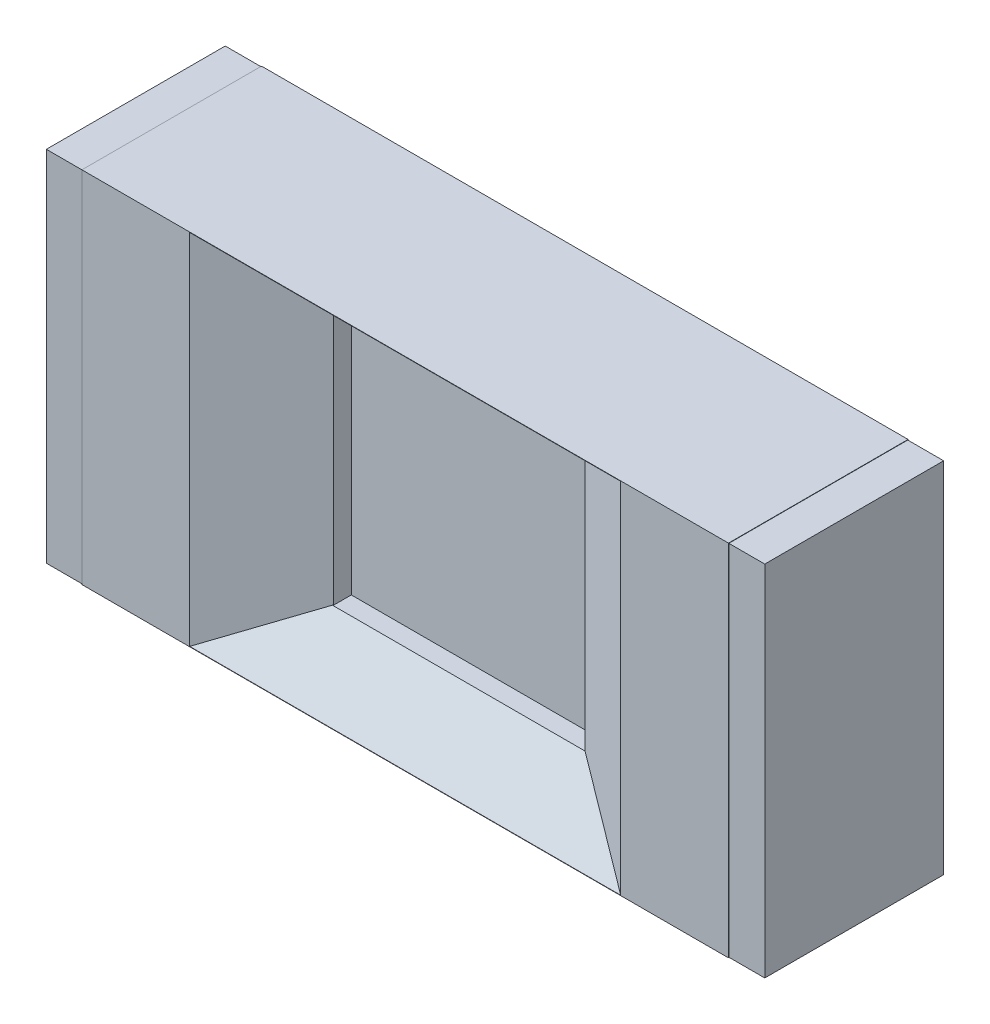
ISO-10303-21;
HEADER;
FILE_DESCRIPTION(('STEP AP214'),'2;1');
FILE_NAME('part.step','',(''),(''),'','','');
FILE_SCHEMA(('AUTOMOTIVE_DESIGN { 1 0 10303 214 1 1 1 1 }'));
ENDSEC;
DATA;
#1=APPLICATION_CONTEXT('core data for automotive mechanical design processes');
#2=APPLICATION_PROTOCOL_DEFINITION('international standard','automotive_design',2000,#1);
#3=PRODUCT_CONTEXT('',#1,'mechanical');
#4=PRODUCT('Part','Part','',(#3));
#5=PRODUCT_RELATED_PRODUCT_CATEGORY('part','',(#4));
#6=PRODUCT_DEFINITION_FORMATION('','',#4);
#7=PRODUCT_DEFINITION_CONTEXT('part definition',#1,'design');
#8=PRODUCT_DEFINITION('design','',#6,#7);
#9=PRODUCT_DEFINITION_SHAPE('','',#8);
#10=(LENGTH_UNIT() NAMED_UNIT(*) SI_UNIT(.MILLI.,.METRE.));
#11=(NAMED_UNIT(*) PLANE_ANGLE_UNIT() SI_UNIT($,.RADIAN.));
#12=(NAMED_UNIT(*) SI_UNIT($,.STERADIAN.) SOLID_ANGLE_UNIT());
#13=UNCERTAINTY_MEASURE_WITH_UNIT(LENGTH_MEASURE(1.E-05),#10,'distance_accuracy_value','');
#14=(GEOMETRIC_REPRESENTATION_CONTEXT(3) GLOBAL_UNCERTAINTY_ASSIGNED_CONTEXT((#13)) GLOBAL_UNIT_ASSIGNED_CONTEXT((#10,
#11,#12)) REPRESENTATION_CONTEXT('',''));
#15=CARTESIAN_POINT('',(0.,0.,0.));
#16=DIRECTION('',(0.,0.,1.));
#17=DIRECTION('',(1.,0.,0.));
#18=AXIS2_PLACEMENT_3D('',#15,#16,#17);
#19=CARTESIAN_POINT('',(28.13,-12.,3.201));
#20=DIRECTION('',(0.,0.,-1.));
#21=DIRECTION('',(0.,-1.,0.));
#22=AXIS2_PLACEMENT_3D('',#19,#20,#21);
#23=PLANE('',#22);
#24=DIRECTION('',(1.,0.,0.));
#25=VECTOR('',#24,1.);
#26=CARTESIAN_POINT('',(28.13,-11.999,3.201));
#27=LINE('',#26,#25);
#28=CARTESIAN_POINT('',(28.03,-11.999,3.201));
#29=VERTEX_POINT('',#28);
#30=CARTESIAN_POINT('',(28.13,-11.999,3.201));
#31=VERTEX_POINT('',#30);
#32=EDGE_CURVE('E258',#29,#31,#27,.T.);
#33=ORIENTED_EDGE('',*,*,#32,.F.);
#34=DIRECTION('',(0.,-1.,0.));
#35=VECTOR('',#34,1.);
#36=CARTESIAN_POINT('',(28.03,-12.,3.201));
#37=LINE('',#36,#35);
#38=CARTESIAN_POINT('',(28.03,-11.001,3.201));
#39=VERTEX_POINT('',#38);
#40=EDGE_CURVE('E11',#39,#29,#37,.T.);
#41=ORIENTED_EDGE('',*,*,#40,.F.);
#42=DIRECTION('',(1.,0.,0.));
#43=VECTOR('',#42,1.);
#44=CARTESIAN_POINT('',(28.13,-11.001,3.201));
#45=LINE('',#44,#43);
#46=CARTESIAN_POINT('',(28.13,-11.001,3.201));
#47=VERTEX_POINT('',#46);
#48=EDGE_CURVE('E290',#39,#47,#45,.T.);
#49=ORIENTED_EDGE('',*,*,#48,.T.);
#50=DIRECTION('',(0.,-1.,0.));
#51=VECTOR('',#50,1.);
#52=CARTESIAN_POINT('',(28.13,-12.,3.201));
#53=LINE('',#52,#51);
#54=EDGE_CURVE('E233',#47,#31,#53,.T.);
#55=ORIENTED_EDGE('',*,*,#54,.T.);
#56=EDGE_LOOP('',(#33,#41,#49,#55));
#57=FACE_BOUND('',#56,.T.);
#58=ADVANCED_FACE('F18',(#57),#23,.T.);
#59=CARTESIAN_POINT('',(28.03,-12.,3.2));
#60=DIRECTION('',(-1.,0.,0.));
#61=DIRECTION('',(0.,0.,1.));
#62=AXIS2_PLACEMENT_3D('',#59,#60,#61);
#63=PLANE('',#62);
#64=ORIENTED_EDGE('',*,*,#40,.T.);
#65=DIRECTION('',(0.,0.,1.));
#66=VECTOR('',#65,1.);
#67=CARTESIAN_POINT('',(28.03,-11.999,3.2));
#68=LINE('',#67,#66);
#69=CARTESIAN_POINT('',(28.03,-11.999,3.699));
#70=VERTEX_POINT('',#69);
#71=EDGE_CURVE('E255',#29,#70,#68,.T.);
#72=ORIENTED_EDGE('',*,*,#71,.T.);
#73=DIRECTION('',(0.,1.,0.));
#74=VECTOR('',#73,1.);
#75=CARTESIAN_POINT('',(28.03,-12.,3.699));
#76=LINE('',#75,#74);
#77=CARTESIAN_POINT('',(28.03,-11.001,3.699));
#78=VERTEX_POINT('',#77);
#79=EDGE_CURVE('E278',#70,#78,#76,.T.);
#80=ORIENTED_EDGE('',*,*,#79,.T.);
#81=DIRECTION('',(0.,0.,-1.));
#82=VECTOR('',#81,1.);
#83=CARTESIAN_POINT('',(28.03,-11.001,3.2));
#84=LINE('',#83,#82);
#85=EDGE_CURVE('E29',#78,#39,#84,.T.);
#86=ORIENTED_EDGE('',*,*,#85,.T.);
#87=EDGE_LOOP('',(#64,#72,#80,#86));
#88=FACE_BOUND('',#87,.T.);
#89=ADVANCED_FACE('F427',(#88),#63,.T.);
#90=CARTESIAN_POINT('',(28.13,-11.001,3.2));
#91=DIRECTION('',(0.,1.,0.));
#92=DIRECTION('',(1.,0.,0.));
#93=AXIS2_PLACEMENT_3D('',#90,#91,#92);
#94=PLANE('',#93);
#95=ORIENTED_EDGE('',*,*,#48,.F.);
#96=ORIENTED_EDGE('',*,*,#85,.F.);
#97=DIRECTION('',(1.,0.,0.));
#98=VECTOR('',#97,1.);
#99=CARTESIAN_POINT('',(28.13,-11.001,3.699));
#100=LINE('',#99,#98);
#101=CARTESIAN_POINT('',(28.13,-11.001,3.699));
#102=VERTEX_POINT('',#101);
#103=EDGE_CURVE('E275',#78,#102,#100,.T.);
#104=ORIENTED_EDGE('',*,*,#103,.T.);
#105=DIRECTION('',(0.,0.,-1.));
#106=VECTOR('',#105,1.);
#107=CARTESIAN_POINT('',(28.13,-11.001,3.2));
#108=LINE('',#107,#106);
#109=EDGE_CURVE('E279',#102,#47,#108,.T.);
#110=ORIENTED_EDGE('',*,*,#109,.T.);
#111=EDGE_LOOP('',(#95,#96,#104,#110));
#112=FACE_BOUND('',#111,.T.);
#113=ADVANCED_FACE('F432',(#112),#94,.T.);
#114=CARTESIAN_POINT('',(28.13,-11.999,3.2));
#115=DIRECTION('',(0.,-1.,0.));
#116=DIRECTION('',(-1.,0.,0.));
#117=AXIS2_PLACEMENT_3D('',#114,#115,#116);
#118=PLANE('',#117);
#119=DIRECTION('',(1.,0.,0.));
#120=VECTOR('',#119,1.);
#121=CARTESIAN_POINT('',(28.13,-11.999,3.699));
#122=LINE('',#121,#120);
#123=CARTESIAN_POINT('',(28.13,-11.999,3.699));
#124=VERTEX_POINT('',#123);
#125=EDGE_CURVE('E259',#70,#124,#122,.T.);
#126=ORIENTED_EDGE('',*,*,#125,.F.);
#127=ORIENTED_EDGE('',*,*,#71,.F.);
#128=ORIENTED_EDGE('',*,*,#32,.T.);
#129=DIRECTION('',(0.,0.,1.));
#130=VECTOR('',#129,1.);
#131=CARTESIAN_POINT('',(28.13,-11.999,3.2));
#132=LINE('',#131,#130);
#133=EDGE_CURVE('E273',#31,#124,#132,.T.);
#134=ORIENTED_EDGE('',*,*,#133,.T.);
#135=EDGE_LOOP('',(#126,#127,#128,#134));
#136=FACE_BOUND('',#135,.T.);
#137=ADVANCED_FACE('F767',(#136),#118,.T.);
#138=CARTESIAN_POINT('',(28.13,-12.,3.699));
#139=DIRECTION('',(0.,0.,1.));
#140=DIRECTION('',(1.,0.,0.));
#141=AXIS2_PLACEMENT_3D('',#138,#139,#140);
#142=PLANE('',#141);
#143=ORIENTED_EDGE('',*,*,#103,.F.);
#144=ORIENTED_EDGE('',*,*,#79,.F.);
#145=ORIENTED_EDGE('',*,*,#125,.T.);
#146=DIRECTION('',(0.,1.,0.));
#147=VECTOR('',#146,1.);
#148=CARTESIAN_POINT('',(28.13,-12.,3.699));
#149=LINE('',#148,#147);
#150=EDGE_CURVE('E269',#124,#102,#149,.T.);
#151=ORIENTED_EDGE('',*,*,#150,.T.);
#152=EDGE_LOOP('',(#143,#144,#145,#151));
#153=FACE_BOUND('',#152,.T.);
#154=ADVANCED_FACE('F691',(#153),#142,.T.);
#155=CARTESIAN_POINT('',(28.13,-11.5,3.45));
#156=DIRECTION('',(-1.,0.,0.));
#157=DIRECTION('',(0.,0.,1.));
#158=AXIS2_PLACEMENT_3D('',#155,#156,#157);
#159=PLANE('',#158);
#160=ORIENTED_EDGE('',*,*,#150,.F.);
#161=ORIENTED_EDGE('',*,*,#133,.F.);
#162=ORIENTED_EDGE('',*,*,#54,.F.);
#163=ORIENTED_EDGE('',*,*,#109,.F.);
#164=EDGE_LOOP('',(#160,#161,#162,#163));
#165=FACE_BOUND('',#164,.T.);
#166=DIRECTION('',(0.,1.,0.));
#167=VECTOR('',#166,1.);
#168=CARTESIAN_POINT('',(28.13,-12.,3.7));
#169=LINE('',#168,#167);
#170=CARTESIAN_POINT('',(28.13,-12.,3.7));
#171=VERTEX_POINT('',#170);
#172=CARTESIAN_POINT('',(28.13,-11.,3.7));
#173=VERTEX_POINT('',#172);
#174=EDGE_CURVE('E268',#171,#173,#169,.T.);
#175=ORIENTED_EDGE('',*,*,#174,.T.);
#176=DIRECTION('',(0.,0.,-1.));
#177=VECTOR('',#176,1.);
#178=CARTESIAN_POINT('',(28.13,-11.,3.2));
#179=LINE('',#178,#177);
#180=CARTESIAN_POINT('',(28.13,-11.,3.2));
#181=VERTEX_POINT('',#180);
#182=EDGE_CURVE('E316',#173,#181,#179,.T.);
#183=ORIENTED_EDGE('',*,*,#182,.T.);
#184=DIRECTION('',(0.,-1.,0.));
#185=VECTOR('',#184,1.);
#186=CARTESIAN_POINT('',(28.13,-12.,3.2));
#187=LINE('',#186,#185);
#188=CARTESIAN_POINT('',(28.13,-12.,3.2));
#189=VERTEX_POINT('',#188);
#190=EDGE_CURVE('E264',#181,#189,#187,.T.);
#191=ORIENTED_EDGE('',*,*,#190,.T.);
#192=DIRECTION('',(0.,0.,1.));
#193=VECTOR('',#192,1.);
#194=CARTESIAN_POINT('',(28.13,-12.,3.2));
#195=LINE('',#194,#193);
#196=EDGE_CURVE('E317',#189,#171,#195,.T.);
#197=ORIENTED_EDGE('',*,*,#196,.T.);
#198=EDGE_LOOP('',(#175,#183,#191,#197));
#199=FACE_BOUND('',#198,.T.);
#200=ADVANCED_FACE('F20',(#165,#199),#159,.T.);
#201=CARTESIAN_POINT('',(29.93,-12.,3.201));
#202=DIRECTION('',(0.,0.,-1.));
#203=DIRECTION('',(-1.,0.,0.));
#204=AXIS2_PLACEMENT_3D('',#201,#202,#203);
#205=PLANE('',#204);
#206=DIRECTION('',(0.,-1.,0.));
#207=VECTOR('',#206,1.);
#208=CARTESIAN_POINT('',(29.93,-12.,3.201));
#209=LINE('',#208,#207);
#210=CARTESIAN_POINT('',(29.93,-11.001,3.201));
#211=VERTEX_POINT('',#210);
#212=CARTESIAN_POINT('',(29.93,-11.999,3.201));
#213=VERTEX_POINT('',#212);
#214=EDGE_CURVE('E299',#211,#213,#209,.T.);
#215=ORIENTED_EDGE('',*,*,#214,.F.);
#216=DIRECTION('',(-1.,0.,0.));
#217=VECTOR('',#216,1.);
#218=CARTESIAN_POINT('',(29.93,-11.001,3.201));
#219=LINE('',#218,#217);
#220=CARTESIAN_POINT('',(30.03,-11.001,3.201));
#221=VERTEX_POINT('',#220);
#222=EDGE_CURVE('E325',#221,#211,#219,.T.);
#223=ORIENTED_EDGE('',*,*,#222,.F.);
#224=DIRECTION('',(0.,-1.,0.));
#225=VECTOR('',#224,1.);
#226=CARTESIAN_POINT('',(30.03,-12.,3.201));
#227=LINE('',#226,#225);
#228=CARTESIAN_POINT('',(30.03,-11.999,3.201));
#229=VERTEX_POINT('',#228);
#230=EDGE_CURVE('E274',#221,#229,#227,.T.);
#231=ORIENTED_EDGE('',*,*,#230,.T.);
#232=DIRECTION('',(-1.,0.,0.));
#233=VECTOR('',#232,1.);
#234=CARTESIAN_POINT('',(29.93,-11.999,3.201));
#235=LINE('',#234,#233);
#236=EDGE_CURVE('E249',#229,#213,#235,.T.);
#237=ORIENTED_EDGE('',*,*,#236,.T.);
#238=EDGE_LOOP('',(#215,#223,#231,#237));
#239=FACE_BOUND('',#238,.T.);
#240=ADVANCED_FACE('F411',(#239),#205,.T.);
#241=CARTESIAN_POINT('',(30.03,-11.,3.2));
#242=DIRECTION('',(1.,0.,0.));
#243=DIRECTION('',(0.,1.,0.));
#244=AXIS2_PLACEMENT_3D('',#241,#242,#243);
#245=PLANE('',#244);
#246=ORIENTED_EDGE('',*,*,#230,.F.);
#247=DIRECTION('',(0.,0.,-1.));
#248=VECTOR('',#247,1.);
#249=CARTESIAN_POINT('',(30.03,-11.001,3.2));
#250=LINE('',#249,#248);
#251=CARTESIAN_POINT('',(30.03,-11.001,3.699));
#252=VERTEX_POINT('',#251);
#253=EDGE_CURVE('E287',#252,#221,#250,.T.);
#254=ORIENTED_EDGE('',*,*,#253,.F.);
#255=DIRECTION('',(0.,1.,0.));
#256=VECTOR('',#255,1.);
#257=CARTESIAN_POINT('',(30.03,-12.,3.699));
#258=LINE('',#257,#256);
#259=CARTESIAN_POINT('',(30.03,-11.999,3.699));
#260=VERTEX_POINT('',#259);
#261=EDGE_CURVE('E238',#260,#252,#258,.T.);
#262=ORIENTED_EDGE('',*,*,#261,.F.);
#263=DIRECTION('',(0.,0.,1.));
#264=VECTOR('',#263,1.);
#265=CARTESIAN_POINT('',(30.03,-11.999,3.2));
#266=LINE('',#265,#264);
#267=EDGE_CURVE('E284',#229,#260,#266,.T.);
#268=ORIENTED_EDGE('',*,*,#267,.F.);
#269=EDGE_LOOP('',(#246,#254,#262,#268));
#270=FACE_BOUND('',#269,.T.);
#271=ADVANCED_FACE('F415',(#270),#245,.T.);
#272=CARTESIAN_POINT('',(29.93,-11.001,3.2));
#273=DIRECTION('',(0.,1.,0.));
#274=DIRECTION('',(1.,0.,0.));
#275=AXIS2_PLACEMENT_3D('',#272,#273,#274);
#276=PLANE('',#275);
#277=DIRECTION('',(0.,0.,-1.));
#278=VECTOR('',#277,1.);
#279=CARTESIAN_POINT('',(29.93,-11.001,3.2));
#280=LINE('',#279,#278);
#281=CARTESIAN_POINT('',(29.93,-11.001,3.699));
#282=VERTEX_POINT('',#281);
#283=EDGE_CURVE('E243',#282,#211,#280,.T.);
#284=ORIENTED_EDGE('',*,*,#283,.F.);
#285=DIRECTION('',(-1.,0.,0.));
#286=VECTOR('',#285,1.);
#287=CARTESIAN_POINT('',(29.93,-11.001,3.699));
#288=LINE('',#287,#286);
#289=EDGE_CURVE('E246',#252,#282,#288,.T.);
#290=ORIENTED_EDGE('',*,*,#289,.F.);
#291=ORIENTED_EDGE('',*,*,#253,.T.);
#292=ORIENTED_EDGE('',*,*,#222,.T.);
#293=EDGE_LOOP('',(#284,#290,#291,#292));
#294=FACE_BOUND('',#293,.T.);
#295=ADVANCED_FACE('F408',(#294),#276,.T.);
#296=CARTESIAN_POINT('',(29.93,-11.999,3.2));
#297=DIRECTION('',(0.,-1.,0.));
#298=DIRECTION('',(0.,0.,-1.));
#299=AXIS2_PLACEMENT_3D('',#296,#297,#298);
#300=PLANE('',#299);
#301=DIRECTION('',(0.,0.,1.));
#302=VECTOR('',#301,1.);
#303=CARTESIAN_POINT('',(29.93,-11.999,3.2));
#304=LINE('',#303,#302);
#305=CARTESIAN_POINT('',(29.93,-11.999,3.699));
#306=VERTEX_POINT('',#305);
#307=EDGE_CURVE('E239',#213,#306,#304,.T.);
#308=ORIENTED_EDGE('',*,*,#307,.F.);
#309=ORIENTED_EDGE('',*,*,#236,.F.);
#310=ORIENTED_EDGE('',*,*,#267,.T.);
#311=DIRECTION('',(-1.,0.,0.));
#312=VECTOR('',#311,1.);
#313=CARTESIAN_POINT('',(29.93,-11.999,3.699));
#314=LINE('',#313,#312);
#315=EDGE_CURVE('E235',#260,#306,#314,.T.);
#316=ORIENTED_EDGE('',*,*,#315,.T.);
#317=EDGE_LOOP('',(#308,#309,#310,#316));
#318=FACE_BOUND('',#317,.T.);
#319=ADVANCED_FACE('F413',(#318),#300,.T.);
#320=CARTESIAN_POINT('',(29.93,-12.,3.699));
#321=DIRECTION('',(0.,0.,1.));
#322=DIRECTION('',(1.,0.,0.));
#323=AXIS2_PLACEMENT_3D('',#320,#321,#322);
#324=PLANE('',#323);
#325=DIRECTION('',(0.,1.,0.));
#326=VECTOR('',#325,1.);
#327=CARTESIAN_POINT('',(29.93,-12.,3.699));
#328=LINE('',#327,#326);
#329=EDGE_CURVE('E240',#306,#282,#328,.T.);
#330=ORIENTED_EDGE('',*,*,#329,.F.);
#331=ORIENTED_EDGE('',*,*,#315,.F.);
#332=ORIENTED_EDGE('',*,*,#261,.T.);
#333=ORIENTED_EDGE('',*,*,#289,.T.);
#334=EDGE_LOOP('',(#330,#331,#332,#333));
#335=FACE_BOUND('',#334,.T.);
#336=ADVANCED_FACE('F403',(#335),#324,.T.);
#337=CARTESIAN_POINT('',(29.93,-11.5,3.45));
#338=DIRECTION('',(1.,0.,0.));
#339=DIRECTION('',(0.,1.,0.));
#340=AXIS2_PLACEMENT_3D('',#337,#338,#339);
#341=PLANE('',#340);
#342=ORIENTED_EDGE('',*,*,#329,.T.);
#343=ORIENTED_EDGE('',*,*,#283,.T.);
#344=ORIENTED_EDGE('',*,*,#214,.T.);
#345=ORIENTED_EDGE('',*,*,#307,.T.);
#346=EDGE_LOOP('',(#342,#343,#344,#345));
#347=FACE_BOUND('',#346,.T.);
#348=DIRECTION('',(0.,1.,0.));
#349=VECTOR('',#348,1.);
#350=CARTESIAN_POINT('',(29.93,-12.,3.7));
#351=LINE('',#350,#349);
#352=CARTESIAN_POINT('',(29.93,-12.,3.7));
#353=VERTEX_POINT('',#352);
#354=CARTESIAN_POINT('',(29.93,-11.,3.7));
#355=VERTEX_POINT('',#354);
#356=EDGE_CURVE('E250',#353,#355,#351,.T.);
#357=ORIENTED_EDGE('',*,*,#356,.F.);
#358=DIRECTION('',(0.,0.,1.));
#359=VECTOR('',#358,1.);
#360=CARTESIAN_POINT('',(29.93,-12.,3.2));
#361=LINE('',#360,#359);
#362=CARTESIAN_POINT('',(29.93,-12.,3.2));
#363=VERTEX_POINT('',#362);
#364=EDGE_CURVE('E371',#363,#353,#361,.T.);
#365=ORIENTED_EDGE('',*,*,#364,.F.);
#366=DIRECTION('',(0.,-1.,0.));
#367=VECTOR('',#366,1.);
#368=CARTESIAN_POINT('',(29.93,-12.,3.2));
#369=LINE('',#368,#367);
#370=CARTESIAN_POINT('',(29.93,-11.,3.2));
#371=VERTEX_POINT('',#370);
#372=EDGE_CURVE('E260',#371,#363,#369,.T.);
#373=ORIENTED_EDGE('',*,*,#372,.F.);
#374=DIRECTION('',(0.,0.,-1.));
#375=VECTOR('',#374,1.);
#376=CARTESIAN_POINT('',(29.93,-11.,3.2));
#377=LINE('',#376,#375);
#378=EDGE_CURVE('E321',#355,#371,#377,.T.);
#379=ORIENTED_EDGE('',*,*,#378,.F.);
#380=EDGE_LOOP('',(#357,#365,#373,#379));
#381=FACE_BOUND('',#380,.T.);
#382=ADVANCED_FACE('F396',(#347,#381),#341,.T.);
#383=CARTESIAN_POINT('',(29.03,-11.5,3.5));
#384=DIRECTION('',(0.,0.,-1.));
#385=DIRECTION('',(0.,-1.,0.));
#386=AXIS2_PLACEMENT_3D('',#383,#384,#385);
#387=PLANE('',#386);
#388=DIRECTION('',(0.,1.,0.));
#389=VECTOR('',#388,1.);
#390=CARTESIAN_POINT('',(28.68,-11.85,3.5));
#391=LINE('',#390,#389);
#392=CARTESIAN_POINT('',(28.68,-11.85,3.5));
#393=VERTEX_POINT('',#392);
#394=CARTESIAN_POINT('',(28.68,-11.15,3.5));
#395=VERTEX_POINT('',#394);
#396=EDGE_CURVE('E344',#393,#395,#391,.T.);
#397=ORIENTED_EDGE('',*,*,#396,.F.);
#398=DIRECTION('',(-1.,0.,0.));
#399=VECTOR('',#398,1.);
#400=CARTESIAN_POINT('',(29.38,-11.85,3.5));
#401=LINE('',#400,#399);
#402=CARTESIAN_POINT('',(29.38,-11.85,3.5));
#403=VERTEX_POINT('',#402);
#404=EDGE_CURVE('E303',#403,#393,#401,.T.);
#405=ORIENTED_EDGE('',*,*,#404,.F.);
#406=DIRECTION('',(0.,-1.,0.));
#407=VECTOR('',#406,1.);
#408=CARTESIAN_POINT('',(29.38,-11.15,3.5));
#409=LINE('',#408,#407);
#410=CARTESIAN_POINT('',(29.38,-11.15,3.5));
#411=VERTEX_POINT('',#410);
#412=EDGE_CURVE('E244',#411,#403,#409,.T.);
#413=ORIENTED_EDGE('',*,*,#412,.F.);
#414=DIRECTION('',(1.,0.,0.));
#415=VECTOR('',#414,1.);
#416=CARTESIAN_POINT('',(28.68,-11.15,3.5));
#417=LINE('',#416,#415);
#418=EDGE_CURVE('E291',#395,#411,#417,.T.);
#419=ORIENTED_EDGE('',*,*,#418,.F.);
#420=EDGE_LOOP('',(#397,#405,#413,#419));
#421=FACE_BOUND('',#420,.T.);
#422=ADVANCED_FACE('F443',(#421),#387,.F.);
#423=CARTESIAN_POINT('',(29.38,-11.15,3.7));
#424=DIRECTION('',(-1.,0.,0.));
#425=DIRECTION('',(0.,0.,1.));
#426=AXIS2_PLACEMENT_3D('',#423,#424,#425);
#427=PLANE('',#426);
#428=DIRECTION('',(0.,0.,-1.));
#429=VECTOR('',#428,1.);
#430=CARTESIAN_POINT('',(29.38,-11.15,3.7));
#431=LINE('',#430,#429);
#432=CARTESIAN_POINT('',(29.38,-11.15,3.55));
#433=VERTEX_POINT('',#432);
#434=EDGE_CURVE('E295',#433,#411,#431,.T.);
#435=ORIENTED_EDGE('',*,*,#434,.T.);
#436=ORIENTED_EDGE('',*,*,#412,.T.);
#437=DIRECTION('',(0.,0.,-1.));
#438=VECTOR('',#437,1.);
#439=CARTESIAN_POINT('',(29.38,-11.85,3.7));
#440=LINE('',#439,#438);
#441=CARTESIAN_POINT('',(29.38,-11.85,3.55));
#442=VERTEX_POINT('',#441);
#443=EDGE_CURVE('E308',#442,#403,#440,.T.);
#444=ORIENTED_EDGE('',*,*,#443,.F.);
#445=DIRECTION('',(0.,-1.,0.));
#446=VECTOR('',#445,1.);
#447=CARTESIAN_POINT('',(29.38,-11.15,3.55));
#448=LINE('',#447,#446);
#449=EDGE_CURVE('E367',#433,#442,#448,.T.);
#450=ORIENTED_EDGE('',*,*,#449,.F.);
#451=EDGE_LOOP('',(#435,#436,#444,#450));
#452=FACE_BOUND('',#451,.T.);
#453=ADVANCED_FACE('F452',(#452),#427,.T.);
#454=CARTESIAN_POINT('',(28.68,-11.85,3.7));
#455=DIRECTION('',(1.,0.,0.));
#456=DIRECTION('',(0.,1.,0.));
#457=AXIS2_PLACEMENT_3D('',#454,#455,#456);
#458=PLANE('',#457);
#459=DIRECTION('',(0.,0.,-1.));
#460=VECTOR('',#459,1.);
#461=CARTESIAN_POINT('',(28.68,-11.85,3.7));
#462=LINE('',#461,#460);
#463=CARTESIAN_POINT('',(28.68,-11.85,3.55));
#464=VERTEX_POINT('',#463);
#465=EDGE_CURVE('E307',#464,#393,#462,.T.);
#466=ORIENTED_EDGE('',*,*,#465,.T.);
#467=ORIENTED_EDGE('',*,*,#396,.T.);
#468=DIRECTION('',(0.,0.,-1.));
#469=VECTOR('',#468,1.);
#470=CARTESIAN_POINT('',(28.68,-11.15,3.7));
#471=LINE('',#470,#469);
#472=CARTESIAN_POINT('',(28.68,-11.15,3.55));
#473=VERTEX_POINT('',#472);
#474=EDGE_CURVE('E263',#473,#395,#471,.T.);
#475=ORIENTED_EDGE('',*,*,#474,.F.);
#476=DIRECTION('',(0.,1.,0.));
#477=VECTOR('',#476,1.);
#478=CARTESIAN_POINT('',(28.68,-11.85,3.55));
#479=LINE('',#478,#477);
#480=EDGE_CURVE('E283',#464,#473,#479,.T.);
#481=ORIENTED_EDGE('',*,*,#480,.F.);
#482=EDGE_LOOP('',(#466,#467,#475,#481));
#483=FACE_BOUND('',#482,.T.);
#484=ADVANCED_FACE('F448',(#483),#458,.T.);
#485=CARTESIAN_POINT('',(29.38,-11.85,3.7));
#486=DIRECTION('',(0.,1.,0.));
#487=DIRECTION('',(1.,0.,0.));
#488=AXIS2_PLACEMENT_3D('',#485,#486,#487);
#489=PLANE('',#488);
#490=DIRECTION('',(-0.857492925712456,0.,-0.514495755427674));
#491=VECTOR('',#490,1.);
#492=CARTESIAN_POINT('',(29.475588235294,-11.85,3.607352941176));
#493=LINE('',#492,#491);
#494=CARTESIAN_POINT('',(29.381666666666,-11.85,3.551));
#495=VERTEX_POINT('',#494);
#496=EDGE_CURVE('E337',#495,#442,#493,.T.);
#497=ORIENTED_EDGE('',*,*,#496,.T.);
#498=ORIENTED_EDGE('',*,*,#443,.T.);
#499=ORIENTED_EDGE('',*,*,#404,.T.);
#500=ORIENTED_EDGE('',*,*,#465,.F.);
#501=DIRECTION('',(0.857492925712456,0.,-0.514495755427674));
#502=VECTOR('',#501,1.);
#503=CARTESIAN_POINT('',(28.841764705882,-11.85,3.452941176471));
#504=LINE('',#503,#502);
#505=CARTESIAN_POINT('',(28.678333333333,-11.85,3.551));
#506=VERTEX_POINT('',#505);
#507=EDGE_CURVE('E205',#506,#464,#504,.T.);
#508=ORIENTED_EDGE('',*,*,#507,.F.);
#509=DIRECTION('',(-1.,0.,0.));
#510=VECTOR('',#509,1.);
#511=CARTESIAN_POINT('',(28.68,-11.85,3.551));
#512=LINE('',#511,#510);
#513=EDGE_CURVE('E200',#495,#506,#512,.T.);
#514=ORIENTED_EDGE('',*,*,#513,.F.);
#515=EDGE_LOOP('',(#497,#498,#499,#500,#508,#514));
#516=FACE_BOUND('',#515,.T.);
#517=ADVANCED_FACE('F451',(#516),#489,.T.);
#518=CARTESIAN_POINT('',(28.68,-11.15,3.7));
#519=DIRECTION('',(0.,-1.,0.));
#520=DIRECTION('',(0.,0.,-1.));
#521=AXIS2_PLACEMENT_3D('',#518,#519,#520);
#522=PLANE('',#521);
#523=DIRECTION('',(0.857492925712456,0.,-0.514495755427674));
#524=VECTOR('',#523,1.);
#525=CARTESIAN_POINT('',(28.584411764705,-11.15,3.607352941176));
#526=LINE('',#525,#524);
#527=CARTESIAN_POINT('',(28.678333333333,-11.15,3.551));
#528=VERTEX_POINT('',#527);
#529=EDGE_CURVE('E206',#528,#473,#526,.T.);
#530=ORIENTED_EDGE('',*,*,#529,.T.);
#531=ORIENTED_EDGE('',*,*,#474,.T.);
#532=ORIENTED_EDGE('',*,*,#418,.T.);
#533=ORIENTED_EDGE('',*,*,#434,.F.);
#534=DIRECTION('',(-0.857492925712456,0.,-0.514495755427674));
#535=VECTOR('',#534,1.);
#536=CARTESIAN_POINT('',(29.218235294117,-11.15,3.452941176471));
#537=LINE('',#536,#535);
#538=CARTESIAN_POINT('',(29.381666666666,-11.15,3.551));
#539=VERTEX_POINT('',#538);
#540=EDGE_CURVE('E336',#539,#433,#537,.T.);
#541=ORIENTED_EDGE('',*,*,#540,.F.);
#542=DIRECTION('',(1.,0.,0.));
#543=VECTOR('',#542,1.);
#544=CARTESIAN_POINT('',(29.38,-11.15,3.551));
#545=LINE('',#544,#543);
#546=EDGE_CURVE('E361',#528,#539,#545,.T.);
#547=ORIENTED_EDGE('',*,*,#546,.F.);
#548=EDGE_LOOP('',(#530,#531,#532,#533,#541,#547));
#549=FACE_BOUND('',#548,.T.);
#550=ADVANCED_FACE('F754',(#549),#522,.T.);
#551=CARTESIAN_POINT('',(29.03,-11.5,3.2));
#552=DIRECTION('',(0.,0.,-1.));
#553=DIRECTION('',(0.,-1.,0.));
#554=AXIS2_PLACEMENT_3D('',#551,#552,#553);
#555=PLANE('',#554);
#556=DIRECTION('',(-1.,0.,0.));
#557=VECTOR('',#556,1.);
#558=CARTESIAN_POINT('',(30.03,-12.,3.2));
#559=LINE('',#558,#557);
#560=EDGE_CURVE('E311',#363,#189,#559,.T.);
#561=ORIENTED_EDGE('',*,*,#560,.T.);
#562=ORIENTED_EDGE('',*,*,#190,.F.);
#563=DIRECTION('',(1.,0.,0.));
#564=VECTOR('',#563,1.);
#565=CARTESIAN_POINT('',(28.03,-11.,3.2));
#566=LINE('',#565,#564);
#567=EDGE_CURVE('E312',#181,#371,#566,.T.);
#568=ORIENTED_EDGE('',*,*,#567,.T.);
#569=ORIENTED_EDGE('',*,*,#372,.T.);
#570=EDGE_LOOP('',(#561,#562,#568,#569));
#571=FACE_BOUND('',#570,.T.);
#572=ADVANCED_FACE('F474',(#571),#555,.T.);
#573=CARTESIAN_POINT('',(29.03,-11.93898373043,3.639983730433));
#574=DIRECTION('',(0.,0.707106781186548,0.707106781186548));
#575=DIRECTION('',(1.,0.,0.));
#576=AXIS2_PLACEMENT_3D('',#573,#574,#575);
#577=PLANE('',#576);
#578=DIRECTION('',(-1.,0.,0.));
#579=VECTOR('',#578,1.);
#580=CARTESIAN_POINT('',(29.63,-11.999,3.7));
#581=LINE('',#580,#579);
#582=CARTESIAN_POINT('',(29.63,-11.999,3.7));
#583=VERTEX_POINT('',#582);
#584=CARTESIAN_POINT('',(28.43,-11.999,3.7));
#585=VERTEX_POINT('',#584);
#586=EDGE_CURVE('E198',#583,#585,#581,.T.);
#587=ORIENTED_EDGE('',*,*,#586,.F.);
#588=DIRECTION('',(-0.762492851662884,0.45749571099793,-0.45749571099793));
#589=VECTOR('',#588,1.);
#590=CARTESIAN_POINT('',(29.406511627907,-11.86490697674,3.565906976744));
#591=LINE('',#590,#589);
#592=EDGE_CURVE('E333',#583,#495,#591,.T.);
#593=ORIENTED_EDGE('',*,*,#592,.T.);
#594=ORIENTED_EDGE('',*,*,#513,.T.);
#595=DIRECTION('',(0.762492851662884,0.45749571099793,-0.45749571099793));
#596=VECTOR('',#595,1.);
#597=CARTESIAN_POINT('',(28.604069767441,-11.89455813953,3.595558139535));
#598=LINE('',#597,#596);
#599=EDGE_CURVE('E193',#585,#506,#598,.T.);
#600=ORIENTED_EDGE('',*,*,#599,.F.);
#601=EDGE_LOOP('',(#587,#593,#594,#600));
#602=FACE_BOUND('',#601,.T.);
#603=ADVANCED_FACE('F195',(#602),#577,.T.);
#604=CARTESIAN_POINT('',(29.505,-11.15,3.625));
#605=DIRECTION('',(0.514495755427674,0.,-0.857492925712456));
#606=DIRECTION('',(0.,-1.,0.));
#607=AXIS2_PLACEMENT_3D('',#604,#605,#606);
#608=PLANE('',#607);
#609=ORIENTED_EDGE('',*,*,#449,.T.);
#610=ORIENTED_EDGE('',*,*,#496,.F.);
#611=ORIENTED_EDGE('',*,*,#592,.F.);
#612=DIRECTION('',(0.,1.,0.));
#613=VECTOR('',#612,1.);
#614=CARTESIAN_POINT('',(29.63,-11.325,3.7));
#615=LINE('',#614,#613);
#616=CARTESIAN_POINT('',(29.63,-11.001,3.7));
#617=VERTEX_POINT('',#616);
#618=EDGE_CURVE('E223',#583,#617,#615,.T.);
#619=ORIENTED_EDGE('',*,*,#618,.T.);
#620=DIRECTION('',(-0.762492851662884,-0.45749571099793,-0.45749571099793));
#621=VECTOR('',#620,1.);
#622=CARTESIAN_POINT('',(29.455930232558,-11.10544186046,3.595558139535));
#623=LINE('',#622,#621);
#624=EDGE_CURVE('E357',#617,#539,#623,.T.);
#625=ORIENTED_EDGE('',*,*,#624,.T.);
#626=ORIENTED_EDGE('',*,*,#540,.T.);
#627=EDGE_LOOP('',(#609,#610,#611,#619,#625,#626));
#628=FACE_BOUND('',#627,.T.);
#629=ADVANCED_FACE('F444',(#628),#608,.F.);
#630=CARTESIAN_POINT('',(28.555,-11.85,3.625));
#631=DIRECTION('',(-0.514495755427674,0.,-0.857492925712456));
#632=DIRECTION('',(-0.857492925712456,0.,0.514495755427674));
#633=AXIS2_PLACEMENT_3D('',#630,#631,#632);
#634=PLANE('',#633);
#635=ORIENTED_EDGE('',*,*,#480,.T.);
#636=ORIENTED_EDGE('',*,*,#529,.F.);
#637=DIRECTION('',(0.762492851662884,-0.45749571099793,-0.45749571099793));
#638=VECTOR('',#637,1.);
#639=CARTESIAN_POINT('',(28.653488372093,-11.13509302325,3.565906976744));
#640=LINE('',#639,#638);
#641=CARTESIAN_POINT('',(28.43,-11.001,3.7));
#642=VERTEX_POINT('',#641);
#643=EDGE_CURVE('E213',#642,#528,#640,.T.);
#644=ORIENTED_EDGE('',*,*,#643,.F.);
#645=DIRECTION('',(0.,-1.,0.));
#646=VECTOR('',#645,1.);
#647=CARTESIAN_POINT('',(28.43,-11.675,3.7));
#648=LINE('',#647,#646);
#649=EDGE_CURVE('E209',#642,#585,#648,.T.);
#650=ORIENTED_EDGE('',*,*,#649,.T.);
#651=ORIENTED_EDGE('',*,*,#599,.T.);
#652=ORIENTED_EDGE('',*,*,#507,.T.);
#653=EDGE_LOOP('',(#635,#636,#644,#650,#651,#652));
#654=FACE_BOUND('',#653,.T.);
#655=ADVANCED_FACE('F211',(#654),#634,.F.);
#656=CARTESIAN_POINT('',(29.03,-11.06101626956,3.639983730433));
#657=DIRECTION('',(0.,-0.707106781186548,0.707106781186548));
#658=DIRECTION('',(-1.,0.,0.));
#659=AXIS2_PLACEMENT_3D('',#656,#657,#658);
#660=PLANE('',#659);
#661=ORIENTED_EDGE('',*,*,#643,.T.);
#662=ORIENTED_EDGE('',*,*,#546,.T.);
#663=ORIENTED_EDGE('',*,*,#624,.F.);
#664=DIRECTION('',(1.,0.,0.));
#665=VECTOR('',#664,1.);
#666=CARTESIAN_POINT('',(28.43,-11.001,3.7));
#667=LINE('',#666,#665);
#668=EDGE_CURVE('E218',#642,#617,#667,.T.);
#669=ORIENTED_EDGE('',*,*,#668,.F.);
#670=EDGE_LOOP('',(#661,#662,#663,#669));
#671=FACE_BOUND('',#670,.T.);
#672=ADVANCED_FACE('F457',(#671),#660,.T.);
#673=CARTESIAN_POINT('',(28.03,-11.,3.2));
#674=DIRECTION('',(0.,1.,0.));
#675=DIRECTION('',(1.,0.,0.));
#676=AXIS2_PLACEMENT_3D('',#673,#674,#675);
#677=PLANE('',#676);
#678=ORIENTED_EDGE('',*,*,#567,.F.);
#679=ORIENTED_EDGE('',*,*,#182,.F.);
#680=DIRECTION('',(1.,0.,0.));
#681=VECTOR('',#680,1.);
#682=CARTESIAN_POINT('',(28.03,-11.,3.7));
#683=LINE('',#682,#681);
#684=EDGE_CURVE('E254',#173,#355,#683,.T.);
#685=ORIENTED_EDGE('',*,*,#684,.T.);
#686=ORIENTED_EDGE('',*,*,#378,.T.);
#687=EDGE_LOOP('',(#678,#679,#685,#686));
#688=FACE_BOUND('',#687,.T.);
#689=ADVANCED_FACE('F460',(#688),#677,.T.);
#690=CARTESIAN_POINT('',(30.03,-12.,3.2));
#691=DIRECTION('',(0.,-1.,0.));
#692=DIRECTION('',(0.,0.,-1.));
#693=AXIS2_PLACEMENT_3D('',#690,#691,#692);
#694=PLANE('',#693);
#695=ORIENTED_EDGE('',*,*,#560,.F.);
#696=ORIENTED_EDGE('',*,*,#364,.T.);
#697=DIRECTION('',(-1.,0.,0.));
#698=VECTOR('',#697,1.);
#699=CARTESIAN_POINT('',(30.03,-12.,3.7));
#700=LINE('',#699,#698);
#701=EDGE_CURVE('E22',#353,#171,#700,.T.);
#702=ORIENTED_EDGE('',*,*,#701,.T.);
#703=ORIENTED_EDGE('',*,*,#196,.F.);
#704=EDGE_LOOP('',(#695,#696,#702,#703));
#705=FACE_BOUND('',#704,.T.);
#706=ADVANCED_FACE('F440',(#705),#694,.T.);
#707=CARTESIAN_POINT('',(29.03,-11.5,3.7));
#708=DIRECTION('',(0.,0.,-1.));
#709=DIRECTION('',(0.,-1.,0.));
#710=AXIS2_PLACEMENT_3D('',#707,#708,#709);
#711=PLANE('',#710);
#712=ORIENTED_EDGE('',*,*,#618,.F.);
#713=ORIENTED_EDGE('',*,*,#586,.T.);
#714=ORIENTED_EDGE('',*,*,#649,.F.);
#715=ORIENTED_EDGE('',*,*,#668,.T.);
#716=EDGE_LOOP('',(#712,#713,#714,#715));
#717=FACE_BOUND('',#716,.T.);
#718=ORIENTED_EDGE('',*,*,#356,.T.);
#719=ORIENTED_EDGE('',*,*,#684,.F.);
#720=ORIENTED_EDGE('',*,*,#174,.F.);
#721=ORIENTED_EDGE('',*,*,#701,.F.);
#722=EDGE_LOOP('',(#718,#719,#720,#721));
#723=FACE_BOUND('',#722,.T.);
#724=ADVANCED_FACE('F220',(#717,#723),#711,.F.);
#725=CLOSED_SHELL('',(#58,#89,#113,#137,#154,#200,#240,#271,#295,#319,#336,#382,#422,#453,#484,
#517,#550,#572,#603,#629,#655,#672,#689,#706,#724));
#726=MANIFOLD_SOLID_BREP('B1',#725);
#727=ADVANCED_BREP_SHAPE_REPRESENTATION('',(#18,#726),#14);
#728=SHAPE_DEFINITION_REPRESENTATION(#9,#727);
ENDSEC;
END-ISO-10303-21;
